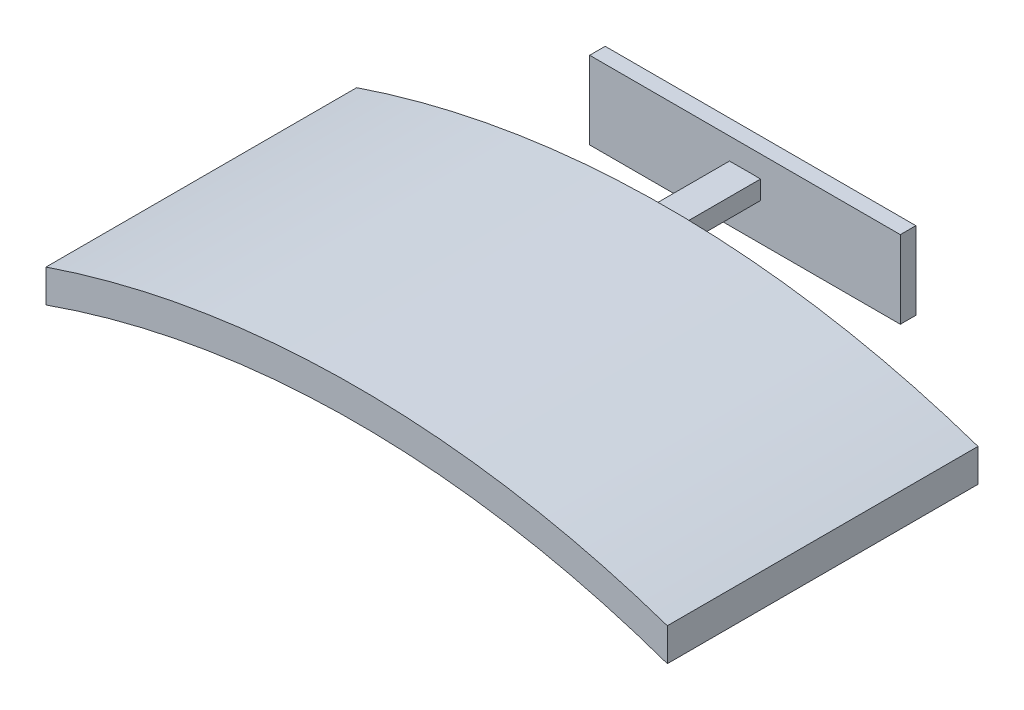
ISO-10303-21;
HEADER;
FILE_DESCRIPTION(('STEP AP214'),'2;1');
FILE_NAME('part.step','',(''),(''),'','','');
FILE_SCHEMA(('AUTOMOTIVE_DESIGN { 1 0 10303 214 1 1 1 1 }'));
ENDSEC;
DATA;
#1=APPLICATION_CONTEXT('core data for automotive mechanical design processes');
#2=APPLICATION_PROTOCOL_DEFINITION('international standard','automotive_design',2000,#1);
#3=PRODUCT_CONTEXT('',#1,'mechanical');
#4=PRODUCT('Part','Part','',(#3));
#5=PRODUCT_RELATED_PRODUCT_CATEGORY('part','',(#4));
#6=PRODUCT_DEFINITION_FORMATION('','',#4);
#7=PRODUCT_DEFINITION_CONTEXT('part definition',#1,'design');
#8=PRODUCT_DEFINITION('design','',#6,#7);
#9=PRODUCT_DEFINITION_SHAPE('','',#8);
#10=(LENGTH_UNIT() NAMED_UNIT(*) SI_UNIT(.MILLI.,.METRE.));
#11=(NAMED_UNIT(*) PLANE_ANGLE_UNIT() SI_UNIT($,.RADIAN.));
#12=(NAMED_UNIT(*) SI_UNIT($,.STERADIAN.) SOLID_ANGLE_UNIT());
#13=UNCERTAINTY_MEASURE_WITH_UNIT(LENGTH_MEASURE(1.E-05),#10,'distance_accuracy_value','');
#14=(GEOMETRIC_REPRESENTATION_CONTEXT(3) GLOBAL_UNCERTAINTY_ASSIGNED_CONTEXT((#13)) GLOBAL_UNIT_ASSIGNED_CONTEXT((#10,
#11,#12)) REPRESENTATION_CONTEXT('',''));
#15=CARTESIAN_POINT('',(0.,0.,0.));
#16=DIRECTION('',(0.,0.,1.));
#17=DIRECTION('',(1.,0.,0.));
#18=AXIS2_PLACEMENT_3D('',#15,#16,#17);
#19=CARTESIAN_POINT('',(200.,-565.685424949238,0.));
#20=DIRECTION('',(0.,0.,-1.));
#21=DIRECTION('',(-1.,0.,0.));
#22=AXIS2_PLACEMENT_3D('',#19,#20,#21);
#23=PLANE('',#22);
#24=CARTESIAN_POINT('',(200.,-565.685424949238,0.));
#25=DIRECTION('',(0.,0.,-1.));
#26=DIRECTION('',(-1.,0.,0.));
#27=AXIS2_PLACEMENT_3D('',#24,#25,#26);
#28=CIRCLE('',#27,600.);
#29=CARTESIAN_POINT('',(0.,0.,0.));
#30=VERTEX_POINT('',#29);
#31=CARTESIAN_POINT('',(400.,0.,0.));
#32=VERTEX_POINT('',#31);
#33=EDGE_CURVE('E233',#30,#32,#28,.T.);
#34=ORIENTED_EDGE('',*,*,#33,.F.);
#35=DIRECTION('',(0.,-1.,0.));
#36=VECTOR('',#35,1.);
#37=CARTESIAN_POINT('',(0.,0.,0.));
#38=LINE('',#37,#36);
#39=CARTESIAN_POINT('',(0.,21.1706050956106,0.));
#40=VERTEX_POINT('',#39);
#41=EDGE_CURVE('E244',#40,#30,#38,.T.);
#42=ORIENTED_EDGE('',*,*,#41,.F.);
#43=CARTESIAN_POINT('',(200.,-565.685424949238,0.));
#44=DIRECTION('',(0.,0.,1.));
#45=DIRECTION('',(-1.,0.,0.));
#46=AXIS2_PLACEMENT_3D('',#43,#44,#45);
#47=CIRCLE('',#46,620.);
#48=CARTESIAN_POINT('',(400.,21.1706050956106,0.));
#49=VERTEX_POINT('',#48);
#50=EDGE_CURVE('E255',#49,#40,#47,.T.);
#51=ORIENTED_EDGE('',*,*,#50,.F.);
#52=DIRECTION('',(0.,1.,0.));
#53=VECTOR('',#52,1.);
#54=CARTESIAN_POINT('',(400.,0.,0.));
#55=LINE('',#54,#53);
#56=EDGE_CURVE('E253',#32,#49,#55,.T.);
#57=ORIENTED_EDGE('',*,*,#56,.F.);
#58=EDGE_LOOP('',(#34,#42,#51,#57));
#59=FACE_BOUND('',#58,.T.);
#60=DIRECTION('',(0.,1.,0.));
#61=VECTOR('',#60,1.);
#62=CARTESIAN_POINT('',(190.,50.2334008711782,0.));
#63=LINE('',#62,#61);
#64=CARTESIAN_POINT('',(190.,38.2317879202082,0.));
#65=VERTEX_POINT('',#64);
#66=CARTESIAN_POINT('',(190.,50.2334008711782,0.));
#67=VERTEX_POINT('',#66);
#68=EDGE_CURVE('E177',#65,#67,#63,.T.);
#69=ORIENTED_EDGE('',*,*,#68,.F.);
#70=CARTESIAN_POINT('',(200.,-565.685424949238,0.));
#71=DIRECTION('',(0.,0.,1.));
#72=DIRECTION('',(-1.,0.,0.));
#73=AXIS2_PLACEMENT_3D('',#70,#71,#72);
#74=CIRCLE('',#73,604.);
#75=CARTESIAN_POINT('',(210.,38.2317879202082,0.));
#76=VERTEX_POINT('',#75);
#77=EDGE_CURVE('E174',#76,#65,#74,.T.);
#78=ORIENTED_EDGE('',*,*,#77,.F.);
#79=DIRECTION('',(0.,-1.,0.));
#80=VECTOR('',#79,1.);
#81=CARTESIAN_POINT('',(210.,50.2334008711781,0.));
#82=LINE('',#81,#80);
#83=CARTESIAN_POINT('',(210.,50.2334008711782,0.));
#84=VERTEX_POINT('',#83);
#85=EDGE_CURVE('E187',#84,#76,#82,.T.);
#86=ORIENTED_EDGE('',*,*,#85,.F.);
#87=CARTESIAN_POINT('',(200.,-565.685424949238,0.));
#88=DIRECTION('',(0.,0.,-1.));
#89=DIRECTION('',(-1.,0.,0.));
#90=AXIS2_PLACEMENT_3D('',#87,#88,#89);
#91=CIRCLE('',#90,616.);
#92=EDGE_CURVE('E198',#67,#84,#91,.T.);
#93=ORIENTED_EDGE('',*,*,#92,.F.);
#94=EDGE_LOOP('',(#69,#78,#86,#93));
#95=FACE_BOUND('',#94,.T.);
#96=ADVANCED_FACE('F35',(#59,#95),#23,.T.);
#97=CARTESIAN_POINT('',(200.,-565.685424949238,200.));
#98=DIRECTION('',(0.,0.,-1.));
#99=DIRECTION('',(-1.,0.,0.));
#100=AXIS2_PLACEMENT_3D('',#97,#98,#99);
#101=CYLINDRICAL_SURFACE('',#100,600.);
#102=ORIENTED_EDGE('',*,*,#33,.T.);
#103=DIRECTION('',(0.,0.,-1.));
#104=VECTOR('',#103,1.);
#105=CARTESIAN_POINT('',(400.,0.,200.));
#106=LINE('',#105,#104);
#107=CARTESIAN_POINT('',(400.,0.,200.));
#108=VERTEX_POINT('',#107);
#109=EDGE_CURVE('E11',#108,#32,#106,.T.);
#110=ORIENTED_EDGE('',*,*,#109,.F.);
#111=CARTESIAN_POINT('',(200.,-565.685424949238,200.));
#112=DIRECTION('',(0.,0.,-1.));
#113=DIRECTION('',(-1.,0.,0.));
#114=AXIS2_PLACEMENT_3D('',#111,#112,#113);
#115=CIRCLE('',#114,600.);
#116=CARTESIAN_POINT('',(0.,0.,200.));
#117=VERTEX_POINT('',#116);
#118=EDGE_CURVE('E240',#117,#108,#115,.T.);
#119=ORIENTED_EDGE('',*,*,#118,.F.);
#120=DIRECTION('',(0.,0.,-1.));
#121=VECTOR('',#120,1.);
#122=CARTESIAN_POINT('',(0.,0.,200.));
#123=LINE('',#122,#121);
#124=EDGE_CURVE('E250',#117,#30,#123,.T.);
#125=ORIENTED_EDGE('',*,*,#124,.T.);
#126=EDGE_LOOP('',(#102,#110,#119,#125));
#127=FACE_BOUND('',#126,.T.);
#128=CARTESIAN_POINT('',(200.,-565.685424949238,2.));
#129=DIRECTION('',(0.,0.,-1.));
#130=DIRECTION('',(1.,0.,0.));
#131=AXIS2_PLACEMENT_3D('',#128,#129,#130);
#132=CIRCLE('',#131,600.);
#133=CARTESIAN_POINT('',(2.00000000000002,0.703134257248772,2.));
#134=VERTEX_POINT('',#133);
#135=CARTESIAN_POINT('',(398.,0.703134257248883,2.));
#136=VERTEX_POINT('',#135);
#137=EDGE_CURVE('E216',#134,#136,#132,.T.);
#138=ORIENTED_EDGE('',*,*,#137,.F.);
#139=DIRECTION('',(0.,0.,1.));
#140=VECTOR('',#139,1.);
#141=CARTESIAN_POINT('',(2.00000000000002,0.703134257248772,2.));
#142=LINE('',#141,#140);
#143=CARTESIAN_POINT('',(2.00000000000002,0.703134257248772,198.));
#144=VERTEX_POINT('',#143);
#145=EDGE_CURVE('E236',#134,#144,#142,.T.);
#146=ORIENTED_EDGE('',*,*,#145,.T.);
#147=CARTESIAN_POINT('',(200.,-565.685424949238,198.));
#148=DIRECTION('',(0.,0.,-1.));
#149=DIRECTION('',(1.,0.,0.));
#150=AXIS2_PLACEMENT_3D('',#147,#148,#149);
#151=CIRCLE('',#150,600.);
#152=CARTESIAN_POINT('',(398.,0.703134257248883,198.));
#153=VERTEX_POINT('',#152);
#154=EDGE_CURVE('E227',#144,#153,#151,.T.);
#155=ORIENTED_EDGE('',*,*,#154,.T.);
#156=DIRECTION('',(0.,0.,1.));
#157=VECTOR('',#156,1.);
#158=CARTESIAN_POINT('',(398.,0.703134257248883,2.));
#159=LINE('',#158,#157);
#160=EDGE_CURVE('E234',#136,#153,#159,.T.);
#161=ORIENTED_EDGE('',*,*,#160,.F.);
#162=EDGE_LOOP('',(#138,#146,#155,#161));
#163=FACE_BOUND('',#162,.T.);
#164=ADVANCED_FACE('F37',(#127,#163),#101,.F.);
#165=CARTESIAN_POINT('',(400.,0.,200.));
#166=DIRECTION('',(-1.,0.,0.));
#167=DIRECTION('',(0.,0.,1.));
#168=AXIS2_PLACEMENT_3D('',#165,#166,#167);
#169=PLANE('',#168);
#170=ORIENTED_EDGE('',*,*,#56,.T.);
#171=DIRECTION('',(0.,0.,-1.));
#172=VECTOR('',#171,1.);
#173=CARTESIAN_POINT('',(400.,21.1706050956106,200.));
#174=LINE('',#173,#172);
#175=CARTESIAN_POINT('',(400.,21.1706050956106,200.));
#176=VERTEX_POINT('',#175);
#177=EDGE_CURVE('E43',#176,#49,#174,.T.);
#178=ORIENTED_EDGE('',*,*,#177,.F.);
#179=DIRECTION('',(0.,1.,0.));
#180=VECTOR('',#179,1.);
#181=CARTESIAN_POINT('',(400.,0.,200.));
#182=LINE('',#181,#180);
#183=EDGE_CURVE('E243',#108,#176,#182,.T.);
#184=ORIENTED_EDGE('',*,*,#183,.F.);
#185=ORIENTED_EDGE('',*,*,#109,.T.);
#186=EDGE_LOOP('',(#170,#178,#184,#185));
#187=FACE_BOUND('',#186,.T.);
#188=ADVANCED_FACE('F284',(#187),#169,.F.);
#189=CARTESIAN_POINT('',(200.,-565.685424949238,200.));
#190=DIRECTION('',(0.,0.,-1.));
#191=DIRECTION('',(-1.,0.,0.));
#192=AXIS2_PLACEMENT_3D('',#189,#190,#191);
#193=CYLINDRICAL_SURFACE('',#192,620.);
#194=ORIENTED_EDGE('',*,*,#50,.T.);
#195=DIRECTION('',(0.,0.,-1.));
#196=VECTOR('',#195,1.);
#197=CARTESIAN_POINT('',(0.,21.1706050956106,200.));
#198=LINE('',#197,#196);
#199=CARTESIAN_POINT('',(0.,21.1706050956106,200.));
#200=VERTEX_POINT('',#199);
#201=EDGE_CURVE('E260',#200,#40,#198,.T.);
#202=ORIENTED_EDGE('',*,*,#201,.F.);
#203=CARTESIAN_POINT('',(200.,-565.685424949238,200.));
#204=DIRECTION('',(0.,0.,1.));
#205=DIRECTION('',(-1.,0.,0.));
#206=AXIS2_PLACEMENT_3D('',#203,#204,#205);
#207=CIRCLE('',#206,620.);
#208=EDGE_CURVE('E246',#176,#200,#207,.T.);
#209=ORIENTED_EDGE('',*,*,#208,.F.);
#210=ORIENTED_EDGE('',*,*,#177,.T.);
#211=EDGE_LOOP('',(#194,#202,#209,#210));
#212=FACE_BOUND('',#211,.T.);
#213=ADVANCED_FACE('F267',(#212),#193,.T.);
#214=CARTESIAN_POINT('',(0.,0.,200.));
#215=DIRECTION('',(1.,0.,0.));
#216=DIRECTION('',(0.,0.,-1.));
#217=AXIS2_PLACEMENT_3D('',#214,#215,#216);
#218=PLANE('',#217);
#219=ORIENTED_EDGE('',*,*,#41,.T.);
#220=ORIENTED_EDGE('',*,*,#124,.F.);
#221=DIRECTION('',(0.,-1.,0.));
#222=VECTOR('',#221,1.);
#223=CARTESIAN_POINT('',(0.,0.,200.));
#224=LINE('',#223,#222);
#225=EDGE_CURVE('E248',#200,#117,#224,.T.);
#226=ORIENTED_EDGE('',*,*,#225,.F.);
#227=ORIENTED_EDGE('',*,*,#201,.T.);
#228=EDGE_LOOP('',(#219,#220,#226,#227));
#229=FACE_BOUND('',#228,.T.);
#230=ADVANCED_FACE('F276',(#229),#218,.F.);
#231=CARTESIAN_POINT('',(200.,-565.685424949238,200.));
#232=DIRECTION('',(0.,0.,-1.));
#233=DIRECTION('',(-1.,0.,0.));
#234=AXIS2_PLACEMENT_3D('',#231,#232,#233);
#235=PLANE('',#234);
#236=ORIENTED_EDGE('',*,*,#118,.T.);
#237=ORIENTED_EDGE('',*,*,#183,.T.);
#238=ORIENTED_EDGE('',*,*,#208,.T.);
#239=ORIENTED_EDGE('',*,*,#225,.T.);
#240=EDGE_LOOP('',(#236,#237,#238,#239));
#241=FACE_BOUND('',#240,.T.);
#242=ADVANCED_FACE('F283',(#241),#235,.F.);
#243=CARTESIAN_POINT('',(200.,-565.685424949238,2.));
#244=DIRECTION('',(0.,0.,1.));
#245=DIRECTION('',(1.,0.,0.));
#246=AXIS2_PLACEMENT_3D('',#243,#244,#245);
#247=CYLINDRICAL_SURFACE('',#246,601.);
#248=CARTESIAN_POINT('',(200.,-565.685424949238,198.));
#249=DIRECTION('',(0.,0.,1.));
#250=DIRECTION('',(1.,0.,0.));
#251=AXIS2_PLACEMENT_3D('',#248,#249,#250);
#252=CIRCLE('',#251,601.);
#253=CARTESIAN_POINT('',(398.,1.76237000638635,198.));
#254=VERTEX_POINT('',#253);
#255=CARTESIAN_POINT('',(2.00000000000002,1.76237000638624,198.));
#256=VERTEX_POINT('',#255);
#257=EDGE_CURVE('E209',#254,#256,#252,.T.);
#258=ORIENTED_EDGE('',*,*,#257,.T.);
#259=DIRECTION('',(0.,0.,1.));
#260=VECTOR('',#259,1.);
#261=CARTESIAN_POINT('',(2.00000000000002,1.76237000638624,2.));
#262=LINE('',#261,#260);
#263=CARTESIAN_POINT('',(2.00000000000002,1.76237000638624,2.));
#264=VERTEX_POINT('',#263);
#265=EDGE_CURVE('E221',#264,#256,#262,.T.);
#266=ORIENTED_EDGE('',*,*,#265,.F.);
#267=CARTESIAN_POINT('',(200.,-565.685424949238,2.));
#268=DIRECTION('',(0.,0.,1.));
#269=DIRECTION('',(1.,0.,0.));
#270=AXIS2_PLACEMENT_3D('',#267,#268,#269);
#271=CIRCLE('',#270,601.);
#272=CARTESIAN_POINT('',(398.,1.76237000638635,2.));
#273=VERTEX_POINT('',#272);
#274=EDGE_CURVE('E210',#273,#264,#271,.T.);
#275=ORIENTED_EDGE('',*,*,#274,.F.);
#276=DIRECTION('',(0.,0.,1.));
#277=VECTOR('',#276,1.);
#278=CARTESIAN_POINT('',(398.,1.76237000638635,2.));
#279=LINE('',#278,#277);
#280=EDGE_CURVE('E231',#273,#254,#279,.T.);
#281=ORIENTED_EDGE('',*,*,#280,.T.);
#282=EDGE_LOOP('',(#258,#266,#275,#281));
#283=FACE_BOUND('',#282,.T.);
#284=ADVANCED_FACE('F302',(#283),#247,.F.);
#285=CARTESIAN_POINT('',(398.,1.76237000638635,2.));
#286=DIRECTION('',(1.,0.,0.));
#287=DIRECTION('',(0.,0.,-1.));
#288=AXIS2_PLACEMENT_3D('',#285,#286,#287);
#289=PLANE('',#288);
#290=DIRECTION('',(0.,1.,0.));
#291=VECTOR('',#290,1.);
#292=CARTESIAN_POINT('',(398.,1.76237000638635,198.));
#293=LINE('',#292,#291);
#294=EDGE_CURVE('E58',#153,#254,#293,.T.);
#295=ORIENTED_EDGE('',*,*,#294,.T.);
#296=ORIENTED_EDGE('',*,*,#280,.F.);
#297=DIRECTION('',(0.,1.,0.));
#298=VECTOR('',#297,1.);
#299=CARTESIAN_POINT('',(398.,1.76237000638635,2.));
#300=LINE('',#299,#298);
#301=EDGE_CURVE('E218',#136,#273,#300,.T.);
#302=ORIENTED_EDGE('',*,*,#301,.F.);
#303=ORIENTED_EDGE('',*,*,#160,.T.);
#304=EDGE_LOOP('',(#295,#296,#302,#303));
#305=FACE_BOUND('',#304,.T.);
#306=ADVANCED_FACE('F306',(#305),#289,.F.);
#307=CARTESIAN_POINT('',(2.00000000000002,1.76237000638624,2.));
#308=DIRECTION('',(-1.,0.,0.));
#309=DIRECTION('',(0.,0.,1.));
#310=AXIS2_PLACEMENT_3D('',#307,#308,#309);
#311=PLANE('',#310);
#312=DIRECTION('',(0.,-1.,0.));
#313=VECTOR('',#312,1.);
#314=CARTESIAN_POINT('',(2.00000000000002,1.76237000638624,198.));
#315=LINE('',#314,#313);
#316=EDGE_CURVE('E224',#256,#144,#315,.T.);
#317=ORIENTED_EDGE('',*,*,#316,.T.);
#318=ORIENTED_EDGE('',*,*,#145,.F.);
#319=DIRECTION('',(0.,-1.,0.));
#320=VECTOR('',#319,1.);
#321=CARTESIAN_POINT('',(2.00000000000002,1.76237000638624,2.));
#322=LINE('',#321,#320);
#323=EDGE_CURVE('E213',#264,#134,#322,.T.);
#324=ORIENTED_EDGE('',*,*,#323,.F.);
#325=ORIENTED_EDGE('',*,*,#265,.T.);
#326=EDGE_LOOP('',(#317,#318,#324,#325));
#327=FACE_BOUND('',#326,.T.);
#328=ADVANCED_FACE('F311',(#327),#311,.F.);
#329=CARTESIAN_POINT('',(200.,-565.685424949238,2.));
#330=DIRECTION('',(0.,0.,1.));
#331=DIRECTION('',(1.,0.,0.));
#332=AXIS2_PLACEMENT_3D('',#329,#330,#331);
#333=PLANE('',#332);
#334=ORIENTED_EDGE('',*,*,#274,.T.);
#335=ORIENTED_EDGE('',*,*,#323,.T.);
#336=ORIENTED_EDGE('',*,*,#137,.T.);
#337=ORIENTED_EDGE('',*,*,#301,.T.);
#338=EDGE_LOOP('',(#334,#335,#336,#337));
#339=FACE_BOUND('',#338,.T.);
#340=ADVANCED_FACE('F316',(#339),#333,.T.);
#341=CARTESIAN_POINT('',(200.,-565.685424949238,198.));
#342=DIRECTION('',(0.,0.,1.));
#343=DIRECTION('',(1.,0.,0.));
#344=AXIS2_PLACEMENT_3D('',#341,#342,#343);
#345=PLANE('',#344);
#346=ORIENTED_EDGE('',*,*,#257,.F.);
#347=ORIENTED_EDGE('',*,*,#294,.F.);
#348=ORIENTED_EDGE('',*,*,#154,.F.);
#349=ORIENTED_EDGE('',*,*,#316,.F.);
#350=EDGE_LOOP('',(#346,#347,#348,#349));
#351=FACE_BOUND('',#350,.T.);
#352=ADVANCED_FACE('F319',(#351),#345,.F.);
#353=CARTESIAN_POINT('',(200.,-565.685424949238,-50.));
#354=DIRECTION('',(0.,0.,1.));
#355=DIRECTION('',(1.,0.,0.));
#356=AXIS2_PLACEMENT_3D('',#353,#354,#355);
#357=CYLINDRICAL_SURFACE('',#356,604.);
#358=ORIENTED_EDGE('',*,*,#77,.T.);
#359=DIRECTION('',(0.,0.,1.));
#360=VECTOR('',#359,1.);
#361=CARTESIAN_POINT('',(190.,38.2317879202082,-50.));
#362=LINE('',#361,#360);
#363=CARTESIAN_POINT('',(190.,38.2317879202082,-50.));
#364=VERTEX_POINT('',#363);
#365=EDGE_CURVE('E207',#364,#65,#362,.T.);
#366=ORIENTED_EDGE('',*,*,#365,.F.);
#367=CARTESIAN_POINT('',(200.,-565.685424949238,-50.));
#368=DIRECTION('',(0.,0.,1.));
#369=DIRECTION('',(-1.,0.,0.));
#370=AXIS2_PLACEMENT_3D('',#367,#368,#369);
#371=CIRCLE('',#370,604.);
#372=CARTESIAN_POINT('',(210.,38.2317879202082,-50.));
#373=VERTEX_POINT('',#372);
#374=EDGE_CURVE('E183',#373,#364,#371,.T.);
#375=ORIENTED_EDGE('',*,*,#374,.F.);
#376=DIRECTION('',(0.,0.,1.));
#377=VECTOR('',#376,1.);
#378=CARTESIAN_POINT('',(210.,38.2317879202082,-50.));
#379=LINE('',#378,#377);
#380=EDGE_CURVE('E195',#373,#76,#379,.T.);
#381=ORIENTED_EDGE('',*,*,#380,.T.);
#382=EDGE_LOOP('',(#358,#366,#375,#381));
#383=FACE_BOUND('',#382,.T.);
#384=ADVANCED_FACE('F322',(#383),#357,.F.);
#385=CARTESIAN_POINT('',(190.,50.2334008711782,-50.));
#386=DIRECTION('',(1.,0.,0.));
#387=DIRECTION('',(0.,1.,0.));
#388=AXIS2_PLACEMENT_3D('',#385,#386,#387);
#389=PLANE('',#388);
#390=ORIENTED_EDGE('',*,*,#68,.T.);
#391=DIRECTION('',(0.,0.,1.));
#392=VECTOR('',#391,1.);
#393=CARTESIAN_POINT('',(190.,50.2334008711782,-50.));
#394=LINE('',#393,#392);
#395=CARTESIAN_POINT('',(190.,50.2334008711782,-50.));
#396=VERTEX_POINT('',#395);
#397=EDGE_CURVE('E204',#396,#67,#394,.T.);
#398=ORIENTED_EDGE('',*,*,#397,.F.);
#399=DIRECTION('',(0.,1.,0.));
#400=VECTOR('',#399,1.);
#401=CARTESIAN_POINT('',(190.,50.2334008711782,-50.));
#402=LINE('',#401,#400);
#403=EDGE_CURVE('E186',#364,#396,#402,.T.);
#404=ORIENTED_EDGE('',*,*,#403,.F.);
#405=ORIENTED_EDGE('',*,*,#365,.T.);
#406=EDGE_LOOP('',(#390,#398,#404,#405));
#407=FACE_BOUND('',#406,.T.);
#408=ADVANCED_FACE('F328',(#407),#389,.F.);
#409=CARTESIAN_POINT('',(200.,-565.685424949238,-50.));
#410=DIRECTION('',(0.,0.,1.));
#411=DIRECTION('',(1.,0.,0.));
#412=AXIS2_PLACEMENT_3D('',#409,#410,#411);
#413=CYLINDRICAL_SURFACE('',#412,616.);
#414=ORIENTED_EDGE('',*,*,#92,.T.);
#415=DIRECTION('',(0.,0.,1.));
#416=VECTOR('',#415,1.);
#417=CARTESIAN_POINT('',(210.,50.2334008711782,-50.));
#418=LINE('',#417,#416);
#419=CARTESIAN_POINT('',(210.,50.2334008711782,-50.));
#420=VERTEX_POINT('',#419);
#421=EDGE_CURVE('E50',#420,#84,#418,.T.);
#422=ORIENTED_EDGE('',*,*,#421,.F.);
#423=CARTESIAN_POINT('',(200.,-565.685424949238,-50.));
#424=DIRECTION('',(0.,0.,-1.));
#425=DIRECTION('',(-1.,0.,0.));
#426=AXIS2_PLACEMENT_3D('',#423,#424,#425);
#427=CIRCLE('',#426,616.);
#428=EDGE_CURVE('E190',#396,#420,#427,.T.);
#429=ORIENTED_EDGE('',*,*,#428,.F.);
#430=ORIENTED_EDGE('',*,*,#397,.T.);
#431=EDGE_LOOP('',(#414,#422,#429,#430));
#432=FACE_BOUND('',#431,.T.);
#433=ADVANCED_FACE('F332',(#432),#413,.T.);
#434=CARTESIAN_POINT('',(210.,50.2334008711781,-50.));
#435=DIRECTION('',(-1.,0.,0.));
#436=DIRECTION('',(0.,0.,1.));
#437=AXIS2_PLACEMENT_3D('',#434,#435,#436);
#438=PLANE('',#437);
#439=ORIENTED_EDGE('',*,*,#85,.T.);
#440=ORIENTED_EDGE('',*,*,#380,.F.);
#441=DIRECTION('',(0.,-1.,0.));
#442=VECTOR('',#441,1.);
#443=CARTESIAN_POINT('',(210.,50.2334008711781,-50.));
#444=LINE('',#443,#442);
#445=EDGE_CURVE('E193',#420,#373,#444,.T.);
#446=ORIENTED_EDGE('',*,*,#445,.F.);
#447=ORIENTED_EDGE('',*,*,#421,.T.);
#448=EDGE_LOOP('',(#439,#440,#446,#447));
#449=FACE_BOUND('',#448,.T.);
#450=ADVANCED_FACE('F336',(#449),#438,.F.);
#451=CARTESIAN_POINT('',(0.,0.,-50.));
#452=DIRECTION('',(0.,0.,-1.));
#453=DIRECTION('',(-1.,0.,0.));
#454=AXIS2_PLACEMENT_3D('',#451,#452,#453);
#455=PLANE('',#454);
#456=DIRECTION('',(0.,-1.,0.));
#457=VECTOR('',#456,1.);
#458=CARTESIAN_POINT('',(300.,64.2325943956932,-50.));
#459=LINE('',#458,#457);
#460=CARTESIAN_POINT('',(300.,64.2325943956932,-50.));
#461=VERTEX_POINT('',#460);
#462=CARTESIAN_POINT('',(300.,14.2325943956932,-50.));
#463=VERTEX_POINT('',#462);
#464=EDGE_CURVE('E173',#461,#463,#459,.T.);
#465=ORIENTED_EDGE('',*,*,#464,.F.);
#466=DIRECTION('',(1.,0.,0.));
#467=VECTOR('',#466,1.);
#468=CARTESIAN_POINT('',(300.,64.2325943956932,-50.));
#469=LINE('',#468,#467);
#470=CARTESIAN_POINT('',(100.,64.2325943956932,-50.));
#471=VERTEX_POINT('',#470);
#472=EDGE_CURVE('E169',#471,#461,#469,.T.);
#473=ORIENTED_EDGE('',*,*,#472,.F.);
#474=DIRECTION('',(0.,1.,0.));
#475=VECTOR('',#474,1.);
#476=CARTESIAN_POINT('',(100.,64.2325943956932,-50.));
#477=LINE('',#476,#475);
#478=CARTESIAN_POINT('',(100.,14.2325943956932,-50.));
#479=VERTEX_POINT('',#478);
#480=EDGE_CURVE('E497',#479,#471,#477,.T.);
#481=ORIENTED_EDGE('',*,*,#480,.F.);
#482=DIRECTION('',(-1.,0.,0.));
#483=VECTOR('',#482,1.);
#484=CARTESIAN_POINT('',(300.,14.2325943956932,-50.));
#485=LINE('',#484,#483);
#486=EDGE_CURVE('E495',#463,#479,#485,.T.);
#487=ORIENTED_EDGE('',*,*,#486,.F.);
#488=EDGE_LOOP('',(#465,#473,#481,#487));
#489=FACE_BOUND('',#488,.T.);
#490=ORIENTED_EDGE('',*,*,#445,.T.);
#491=ORIENTED_EDGE('',*,*,#374,.T.);
#492=ORIENTED_EDGE('',*,*,#403,.T.);
#493=ORIENTED_EDGE('',*,*,#428,.T.);
#494=EDGE_LOOP('',(#490,#491,#492,#493));
#495=FACE_BOUND('',#494,.T.);
#496=ADVANCED_FACE('F340',(#489,#495),#455,.F.);
#497=CARTESIAN_POINT('',(300.,64.2325943956932,-60.));
#498=DIRECTION('',(-1.,0.,0.));
#499=DIRECTION('',(0.,0.,1.));
#500=AXIS2_PLACEMENT_3D('',#497,#498,#499);
#501=PLANE('',#500);
#502=ORIENTED_EDGE('',*,*,#464,.T.);
#503=DIRECTION('',(0.,0.,1.));
#504=VECTOR('',#503,1.);
#505=CARTESIAN_POINT('',(300.,14.2325943956932,-60.));
#506=LINE('',#505,#504);
#507=CARTESIAN_POINT('',(300.,14.2325943956932,-60.));
#508=VERTEX_POINT('',#507);
#509=EDGE_CURVE('E153',#508,#463,#506,.T.);
#510=ORIENTED_EDGE('',*,*,#509,.F.);
#511=DIRECTION('',(0.,-1.,0.));
#512=VECTOR('',#511,1.);
#513=CARTESIAN_POINT('',(300.,64.2325943956932,-60.));
#514=LINE('',#513,#512);
#515=CARTESIAN_POINT('',(300.,64.2325943956932,-60.));
#516=VERTEX_POINT('',#515);
#517=EDGE_CURVE('E160',#516,#508,#514,.T.);
#518=ORIENTED_EDGE('',*,*,#517,.F.);
#519=DIRECTION('',(0.,0.,1.));
#520=VECTOR('',#519,1.);
#521=CARTESIAN_POINT('',(300.,64.2325943956932,-60.));
#522=LINE('',#521,#520);
#523=EDGE_CURVE('E504',#516,#461,#522,.T.);
#524=ORIENTED_EDGE('',*,*,#523,.T.);
#525=EDGE_LOOP('',(#502,#510,#518,#524));
#526=FACE_BOUND('',#525,.T.);
#527=ADVANCED_FACE('F171',(#526),#501,.F.);
#528=CARTESIAN_POINT('',(300.,14.2325943956932,-60.));
#529=DIRECTION('',(0.,1.,0.));
#530=DIRECTION('',(0.,0.,1.));
#531=AXIS2_PLACEMENT_3D('',#528,#529,#530);
#532=PLANE('',#531);
#533=ORIENTED_EDGE('',*,*,#486,.T.);
#534=DIRECTION('',(0.,0.,1.));
#535=VECTOR('',#534,1.);
#536=CARTESIAN_POINT('',(100.,14.2325943956932,-60.));
#537=LINE('',#536,#535);
#538=CARTESIAN_POINT('',(100.,14.2325943956932,-60.));
#539=VERTEX_POINT('',#538);
#540=EDGE_CURVE('E156',#539,#479,#537,.T.);
#541=ORIENTED_EDGE('',*,*,#540,.F.);
#542=DIRECTION('',(-1.,0.,0.));
#543=VECTOR('',#542,1.);
#544=CARTESIAN_POINT('',(300.,14.2325943956932,-60.));
#545=LINE('',#544,#543);
#546=EDGE_CURVE('E149',#508,#539,#545,.T.);
#547=ORIENTED_EDGE('',*,*,#546,.F.);
#548=ORIENTED_EDGE('',*,*,#509,.T.);
#549=EDGE_LOOP('',(#533,#541,#547,#548));
#550=FACE_BOUND('',#549,.T.);
#551=ADVANCED_FACE('F151',(#550),#532,.F.);
#552=CARTESIAN_POINT('',(100.,64.2325943956932,-60.));
#553=DIRECTION('',(1.,0.,0.));
#554=DIRECTION('',(0.,0.,-1.));
#555=AXIS2_PLACEMENT_3D('',#552,#553,#554);
#556=PLANE('',#555);
#557=ORIENTED_EDGE('',*,*,#480,.T.);
#558=DIRECTION('',(0.,0.,1.));
#559=VECTOR('',#558,1.);
#560=CARTESIAN_POINT('',(100.,64.2325943956932,-60.));
#561=LINE('',#560,#559);
#562=CARTESIAN_POINT('',(100.,64.2325943956932,-60.));
#563=VERTEX_POINT('',#562);
#564=EDGE_CURVE('E179',#563,#471,#561,.T.);
#565=ORIENTED_EDGE('',*,*,#564,.F.);
#566=DIRECTION('',(0.,1.,0.));
#567=VECTOR('',#566,1.);
#568=CARTESIAN_POINT('',(100.,64.2325943956932,-60.));
#569=LINE('',#568,#567);
#570=EDGE_CURVE('E159',#539,#563,#569,.T.);
#571=ORIENTED_EDGE('',*,*,#570,.F.);
#572=ORIENTED_EDGE('',*,*,#540,.T.);
#573=EDGE_LOOP('',(#557,#565,#571,#572));
#574=FACE_BOUND('',#573,.T.);
#575=ADVANCED_FACE('F345',(#574),#556,.F.);
#576=CARTESIAN_POINT('',(300.,64.2325943956932,-60.));
#577=DIRECTION('',(0.,-1.,0.));
#578=DIRECTION('',(0.,0.,-1.));
#579=AXIS2_PLACEMENT_3D('',#576,#577,#578);
#580=PLANE('',#579);
#581=ORIENTED_EDGE('',*,*,#472,.T.);
#582=ORIENTED_EDGE('',*,*,#523,.F.);
#583=DIRECTION('',(1.,0.,0.));
#584=VECTOR('',#583,1.);
#585=CARTESIAN_POINT('',(300.,64.2325943956932,-60.));
#586=LINE('',#585,#584);
#587=EDGE_CURVE('E165',#563,#516,#586,.T.);
#588=ORIENTED_EDGE('',*,*,#587,.F.);
#589=ORIENTED_EDGE('',*,*,#564,.T.);
#590=EDGE_LOOP('',(#581,#582,#588,#589));
#591=FACE_BOUND('',#590,.T.);
#592=ADVANCED_FACE('F348',(#591),#580,.F.);
#593=CARTESIAN_POINT('',(0.,0.,-60.));
#594=DIRECTION('',(0.,0.,-1.));
#595=DIRECTION('',(-1.,0.,0.));
#596=AXIS2_PLACEMENT_3D('',#593,#594,#595);
#597=PLANE('',#596);
#598=ORIENTED_EDGE('',*,*,#517,.T.);
#599=ORIENTED_EDGE('',*,*,#546,.T.);
#600=ORIENTED_EDGE('',*,*,#570,.T.);
#601=ORIENTED_EDGE('',*,*,#587,.T.);
#602=EDGE_LOOP('',(#598,#599,#600,#601));
#603=FACE_BOUND('',#602,.T.);
#604=ADVANCED_FACE('F163',(#603),#597,.T.);
#605=CLOSED_SHELL('',(#96,#164,#188,#213,#230,#242,#284,#306,#328,#340,#352,#384,#408,#433,#450,
#496,#527,#551,#575,#592,#604));
#606=MANIFOLD_SOLID_BREP('B2',#605);
#607=ADVANCED_BREP_SHAPE_REPRESENTATION('',(#18,#606),#14);
#608=SHAPE_DEFINITION_REPRESENTATION(#9,#607);
ENDSEC;
END-ISO-10303-21;
